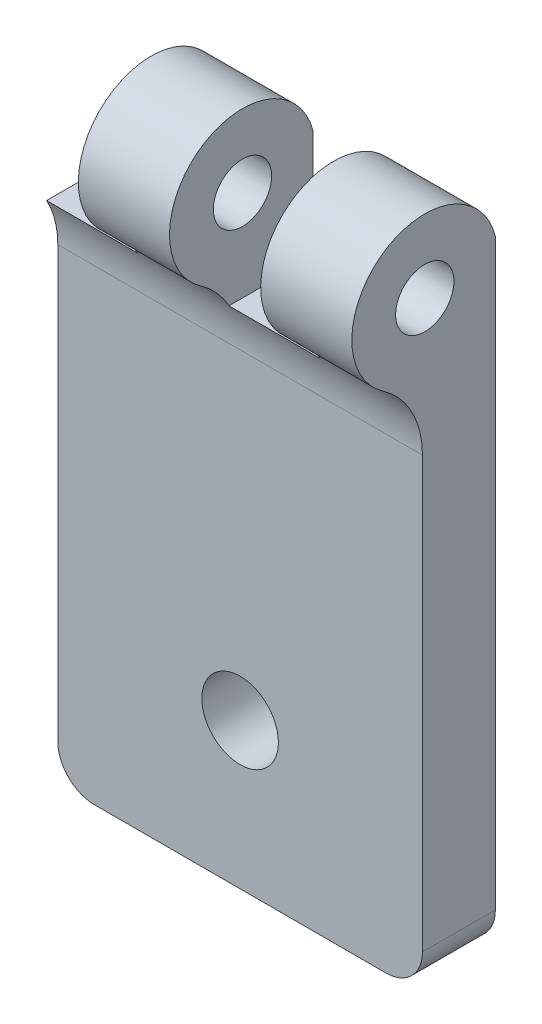
ISO-10303-21;
HEADER;
FILE_DESCRIPTION(('STEP AP214'),'2;1');
FILE_NAME('part.step','',(''),(''),'','','');
FILE_SCHEMA(('AUTOMOTIVE_DESIGN { 1 0 10303 214 1 1 1 1 }'));
ENDSEC;
DATA;
#1=APPLICATION_CONTEXT('core data for automotive mechanical design processes');
#2=APPLICATION_PROTOCOL_DEFINITION('international standard','automotive_design',2000,#1);
#3=PRODUCT_CONTEXT('',#1,'mechanical');
#4=PRODUCT('Part','Part','',(#3));
#5=PRODUCT_RELATED_PRODUCT_CATEGORY('part','',(#4));
#6=PRODUCT_DEFINITION_FORMATION('','',#4);
#7=PRODUCT_DEFINITION_CONTEXT('part definition',#1,'design');
#8=PRODUCT_DEFINITION('design','',#6,#7);
#9=PRODUCT_DEFINITION_SHAPE('','',#8);
#10=(LENGTH_UNIT() NAMED_UNIT(*) SI_UNIT(.MILLI.,.METRE.));
#11=(NAMED_UNIT(*) PLANE_ANGLE_UNIT() SI_UNIT($,.RADIAN.));
#12=(NAMED_UNIT(*) SI_UNIT($,.STERADIAN.) SOLID_ANGLE_UNIT());
#13=UNCERTAINTY_MEASURE_WITH_UNIT(LENGTH_MEASURE(1.E-05),#10,'distance_accuracy_value','');
#14=(GEOMETRIC_REPRESENTATION_CONTEXT(3) GLOBAL_UNCERTAINTY_ASSIGNED_CONTEXT((#13)) GLOBAL_UNIT_ASSIGNED_CONTEXT((#10,
#11,#12)) REPRESENTATION_CONTEXT('',''));
#15=CARTESIAN_POINT('',(0.,0.,0.));
#16=DIRECTION('',(0.,0.,1.));
#17=DIRECTION('',(1.,0.,0.));
#18=AXIS2_PLACEMENT_3D('',#15,#16,#17);
#19=CARTESIAN_POINT('',(-31.2224351555829,32.9979661007594,3.87245762594928));
#20=DIRECTION('',(1.,0.,0.));
#21=DIRECTION('',(0.,0.,-1.));
#22=AXIS2_PLACEMENT_3D('',#19,#20,#21);
#23=CYLINDRICAL_SURFACE('',#22,4.);
#24=CARTESIAN_POINT('',(-5.,32.9979661007594,3.87245762594928));
#25=DIRECTION('',(1.,0.,0.));
#26=DIRECTION('',(0.,0.,-1.));
#27=AXIS2_PLACEMENT_3D('',#24,#25,#26);
#28=CIRCLE('',#27,4.);
#29=CARTESIAN_POINT('',(-5.,29.7106298545688,6.1513653477496));
#30=VERTEX_POINT('',#29);
#31=CARTESIAN_POINT('',(-5.,34.,0.));
#32=VERTEX_POINT('',#31);
#33=EDGE_CURVE('E175',#30,#32,#28,.F.);
#34=ORIENTED_EDGE('',*,*,#33,.F.);
#35=DIRECTION('',(1.,0.,0.));
#36=VECTOR('',#35,1.);
#37=CARTESIAN_POINT('',(-31.2224351555829,29.7106298545688,6.1513653477496));
#38=LINE('',#37,#36);
#39=CARTESIAN_POINT('',(0.,29.7106298545688,6.1513653477496));
#40=VERTEX_POINT('',#39);
#41=EDGE_CURVE('E199',#30,#40,#38,.T.);
#42=ORIENTED_EDGE('',*,*,#41,.T.);
#43=CARTESIAN_POINT('',(0.,32.9979661007594,3.87245762594928));
#44=DIRECTION('',(1.,0.,0.));
#45=DIRECTION('',(0.,0.,-1.));
#46=AXIS2_PLACEMENT_3D('',#43,#44,#45);
#47=CIRCLE('',#46,4.);
#48=CARTESIAN_POINT('',(0.,34.,0.));
#49=VERTEX_POINT('',#48);
#50=EDGE_CURVE('E186',#49,#40,#47,.T.);
#51=ORIENTED_EDGE('',*,*,#50,.F.);
#52=DIRECTION('',(-1.,0.,0.));
#53=VECTOR('',#52,1.);
#54=CARTESIAN_POINT('',(0.,34.,0.));
#55=LINE('',#54,#53);
#56=EDGE_CURVE('E202',#49,#32,#55,.T.);
#57=ORIENTED_EDGE('',*,*,#56,.T.);
#58=EDGE_LOOP('',(#34,#42,#51,#57));
#59=FACE_BOUND('',#58,.T.);
#60=ADVANCED_FACE('F33',(#59),#23,.T.);
#61=CARTESIAN_POINT('',(-20.,32.9979661007594,3.87245762594928));
#62=DIRECTION('',(1.,0.,0.));
#63=DIRECTION('',(0.,0.,-1.));
#64=AXIS2_PLACEMENT_3D('',#61,#62,#63);
#65=CYLINDRICAL_SURFACE('',#64,1.6);
#66=CARTESIAN_POINT('',(-5.,32.9979661007594,3.87245762594928));
#67=DIRECTION('',(1.,0.,0.));
#68=DIRECTION('',(0.,0.,-1.));
#69=AXIS2_PLACEMENT_3D('',#66,#67,#68);
#70=CIRCLE('',#69,1.6);
#71=CARTESIAN_POINT('',(-5.,32.9979661007594,2.27245762594928));
#72=VERTEX_POINT('',#71);
#73=EDGE_CURVE('E171',#72,#72,#70,.F.);
#74=ORIENTED_EDGE('',*,*,#73,.T.);
#75=EDGE_LOOP('',(#74));
#76=FACE_BOUND('',#75,.T.);
#77=CARTESIAN_POINT('',(0.,32.9979661007594,3.87245762594928));
#78=DIRECTION('',(1.,0.,0.));
#79=DIRECTION('',(0.,0.,-1.));
#80=AXIS2_PLACEMENT_3D('',#77,#78,#79);
#81=CIRCLE('',#80,1.6);
#82=CARTESIAN_POINT('',(0.,32.9979661007594,2.27245762594928));
#83=VERTEX_POINT('',#82);
#84=EDGE_CURVE('E181',#83,#83,#81,.T.);
#85=ORIENTED_EDGE('',*,*,#84,.T.);
#86=EDGE_LOOP('',(#85));
#87=FACE_BOUND('',#86,.T.);
#88=ADVANCED_FACE('F255',(#76,#87),#65,.F.);
#89=CARTESIAN_POINT('',(0.,0.,4.));
#90=DIRECTION('',(-1.,0.,0.));
#91=DIRECTION('',(0.,0.,1.));
#92=AXIS2_PLACEMENT_3D('',#89,#90,#91);
#93=PLANE('',#92);
#94=ORIENTED_EDGE('',*,*,#84,.F.);
#95=EDGE_LOOP('',(#94));
#96=FACE_BOUND('',#95,.T.);
#97=DIRECTION('',(0.,1.,0.));
#98=VECTOR('',#97,1.);
#99=CARTESIAN_POINT('',(0.,0.,4.));
#100=LINE('',#99,#98);
#101=CARTESIAN_POINT('',(0.,2.,4.));
#102=VERTEX_POINT('',#101);
#103=CARTESIAN_POINT('',(0.,25.6014595468304,4.));
#104=VERTEX_POINT('',#103);
#105=EDGE_CURVE('E190',#102,#104,#100,.T.);
#106=ORIENTED_EDGE('',*,*,#105,.F.);
#107=DIRECTION('',(0.,0.,-1.));
#108=VECTOR('',#107,1.);
#109=CARTESIAN_POINT('',(0.,2.,4.));
#110=LINE('',#109,#108);
#111=CARTESIAN_POINT('',(0.,2.,0.));
#112=VERTEX_POINT('',#111);
#113=EDGE_CURVE('E218',#102,#112,#110,.T.);
#114=ORIENTED_EDGE('',*,*,#113,.T.);
#115=DIRECTION('',(0.,1.,0.));
#116=VECTOR('',#115,1.);
#117=CARTESIAN_POINT('',(0.,0.,0.));
#118=LINE('',#117,#116);
#119=EDGE_CURVE('E189',#112,#49,#118,.T.);
#120=ORIENTED_EDGE('',*,*,#119,.T.);
#121=ORIENTED_EDGE('',*,*,#50,.T.);
#122=CARTESIAN_POINT('',(0.,25.6014595468304,9.));
#123=DIRECTION('',(-1.,0.,0.));
#124=DIRECTION('',(0.,0.,1.));
#125=AXIS2_PLACEMENT_3D('',#122,#123,#124);
#126=CIRCLE('',#125,5.);
#127=EDGE_CURVE('E212',#40,#104,#126,.T.);
#128=ORIENTED_EDGE('',*,*,#127,.T.);
#129=EDGE_LOOP('',(#106,#114,#120,#121,#128));
#130=FACE_BOUND('',#129,.T.);
#131=ADVANCED_FACE('F262',(#96,#130),#93,.F.);
#132=CARTESIAN_POINT('',(-20.,0.,4.));
#133=DIRECTION('',(1.,0.,0.));
#134=DIRECTION('',(0.,0.,-1.));
#135=AXIS2_PLACEMENT_3D('',#132,#133,#134);
#136=PLANE('',#135);
#137=CARTESIAN_POINT('',(-20.,25.6014595468304,9.));
#138=DIRECTION('',(1.,0.,0.));
#139=DIRECTION('',(0.,0.,-1.));
#140=AXIS2_PLACEMENT_3D('',#137,#138,#139);
#141=CIRCLE('',#140,5.);
#142=CARTESIAN_POINT('',(-20.,25.6014595468304,4.));
#143=VERTEX_POINT('',#142);
#144=CARTESIAN_POINT('',(-20.,28.,4.61285928029323));
#145=VERTEX_POINT('',#144);
#146=EDGE_CURVE('E215',#143,#145,#141,.T.);
#147=ORIENTED_EDGE('',*,*,#146,.T.);
#148=DIRECTION('',(0.,0.,-1.));
#149=VECTOR('',#148,1.);
#150=CARTESIAN_POINT('',(-20.,28.,7.87245762594928));
#151=LINE('',#150,#149);
#152=CARTESIAN_POINT('',(-20.,28.,0.));
#153=VERTEX_POINT('',#152);
#154=EDGE_CURVE('E48',#145,#153,#151,.T.);
#155=ORIENTED_EDGE('',*,*,#154,.T.);
#156=DIRECTION('',(0.,-1.,0.));
#157=VECTOR('',#156,1.);
#158=CARTESIAN_POINT('',(-20.,0.,0.));
#159=LINE('',#158,#157);
#160=CARTESIAN_POINT('',(-20.,2.,0.));
#161=VERTEX_POINT('',#160);
#162=EDGE_CURVE('E146',#153,#161,#159,.T.);
#163=ORIENTED_EDGE('',*,*,#162,.T.);
#164=DIRECTION('',(0.,0.,-1.));
#165=VECTOR('',#164,1.);
#166=CARTESIAN_POINT('',(-20.,2.,4.));
#167=LINE('',#166,#165);
#168=CARTESIAN_POINT('',(-20.,2.,4.));
#169=VERTEX_POINT('',#168);
#170=EDGE_CURVE('E234',#161,#169,#167,.F.);
#171=ORIENTED_EDGE('',*,*,#170,.T.);
#172=DIRECTION('',(0.,-1.,0.));
#173=VECTOR('',#172,1.);
#174=CARTESIAN_POINT('',(-20.,0.,4.));
#175=LINE('',#174,#173);
#176=EDGE_CURVE('E192',#143,#169,#175,.T.);
#177=ORIENTED_EDGE('',*,*,#176,.F.);
#178=EDGE_LOOP('',(#147,#155,#163,#171,#177));
#179=FACE_BOUND('',#178,.T.);
#180=ADVANCED_FACE('F314',(#179),#136,.F.);
#181=CARTESIAN_POINT('',(0.,0.,4.));
#182=DIRECTION('',(0.,1.,0.));
#183=DIRECTION('',(-1.,0.,0.));
#184=AXIS2_PLACEMENT_3D('',#181,#182,#183);
#185=PLANE('',#184);
#186=DIRECTION('',(1.,0.,0.));
#187=VECTOR('',#186,1.);
#188=CARTESIAN_POINT('',(0.,0.,0.));
#189=LINE('',#188,#187);
#190=CARTESIAN_POINT('',(-18.,0.,0.));
#191=VERTEX_POINT('',#190);
#192=CARTESIAN_POINT('',(-2.,0.,0.));
#193=VERTEX_POINT('',#192);
#194=EDGE_CURVE('E193',#191,#193,#189,.T.);
#195=ORIENTED_EDGE('',*,*,#194,.T.);
#196=DIRECTION('',(0.,0.,-1.));
#197=VECTOR('',#196,1.);
#198=CARTESIAN_POINT('',(-2.,0.,4.));
#199=LINE('',#198,#197);
#200=CARTESIAN_POINT('',(-2.,0.,4.));
#201=VERTEX_POINT('',#200);
#202=EDGE_CURVE('E228',#193,#201,#199,.F.);
#203=ORIENTED_EDGE('',*,*,#202,.T.);
#204=DIRECTION('',(1.,0.,0.));
#205=VECTOR('',#204,1.);
#206=CARTESIAN_POINT('',(0.,0.,4.));
#207=LINE('',#206,#205);
#208=CARTESIAN_POINT('',(-18.,0.,4.));
#209=VERTEX_POINT('',#208);
#210=EDGE_CURVE('E196',#209,#201,#207,.T.);
#211=ORIENTED_EDGE('',*,*,#210,.F.);
#212=DIRECTION('',(0.,0.,-1.));
#213=VECTOR('',#212,1.);
#214=CARTESIAN_POINT('',(-18.,0.,4.));
#215=LINE('',#214,#213);
#216=EDGE_CURVE('E225',#209,#191,#215,.T.);
#217=ORIENTED_EDGE('',*,*,#216,.T.);
#218=EDGE_LOOP('',(#195,#203,#211,#217));
#219=FACE_BOUND('',#218,.T.);
#220=ADVANCED_FACE('F306',(#219),#185,.F.);
#221=CARTESIAN_POINT('',(0.,0.,4.));
#222=DIRECTION('',(0.,0.,1.));
#223=DIRECTION('',(1.,0.,0.));
#224=AXIS2_PLACEMENT_3D('',#221,#222,#223);
#225=PLANE('',#224);
#226=CARTESIAN_POINT('',(-10.,8.,4.));
#227=DIRECTION('',(0.,0.,1.));
#228=DIRECTION('',(1.,0.,0.));
#229=AXIS2_PLACEMENT_3D('',#226,#227,#228);
#230=CIRCLE('',#229,2.1);
#231=CARTESIAN_POINT('',(-7.9,8.,4.));
#232=VERTEX_POINT('',#231);
#233=EDGE_CURVE('E177',#232,#232,#230,.T.);
#234=ORIENTED_EDGE('',*,*,#233,.F.);
#235=EDGE_LOOP('',(#234));
#236=FACE_BOUND('',#235,.T.);
#237=ORIENTED_EDGE('',*,*,#210,.T.);
#238=CARTESIAN_POINT('',(-2.,2.,4.));
#239=DIRECTION('',(0.,0.,1.));
#240=DIRECTION('',(1.,0.,0.));
#241=AXIS2_PLACEMENT_3D('',#238,#239,#240);
#242=CIRCLE('',#241,2.);
#243=EDGE_CURVE('E232',#201,#102,#242,.T.);
#244=ORIENTED_EDGE('',*,*,#243,.T.);
#245=ORIENTED_EDGE('',*,*,#105,.T.);
#246=DIRECTION('',(-1.,0.,0.));
#247=VECTOR('',#246,1.);
#248=CARTESIAN_POINT('',(-20.,25.6014595468304,4.));
#249=LINE('',#248,#247);
#250=EDGE_CURVE('E210',#104,#143,#249,.T.);
#251=ORIENTED_EDGE('',*,*,#250,.T.);
#252=ORIENTED_EDGE('',*,*,#176,.T.);
#253=CARTESIAN_POINT('',(-18.,2.,4.));
#254=DIRECTION('',(0.,0.,1.));
#255=DIRECTION('',(1.,0.,0.));
#256=AXIS2_PLACEMENT_3D('',#253,#254,#255);
#257=CIRCLE('',#256,2.);
#258=EDGE_CURVE('E230',#169,#209,#257,.T.);
#259=ORIENTED_EDGE('',*,*,#258,.T.);
#260=EDGE_LOOP('',(#237,#244,#245,#251,#252,#259));
#261=FACE_BOUND('',#260,.T.);
#262=ADVANCED_FACE('F275',(#236,#261),#225,.T.);
#263=CARTESIAN_POINT('',(0.,0.,0.));
#264=DIRECTION('',(0.,0.,1.));
#265=DIRECTION('',(1.,0.,0.));
#266=AXIS2_PLACEMENT_3D('',#263,#264,#265);
#267=PLANE('',#266);
#268=CARTESIAN_POINT('',(-10.,8.,0.));
#269=DIRECTION('',(0.,0.,1.));
#270=DIRECTION('',(1.,0.,0.));
#271=AXIS2_PLACEMENT_3D('',#268,#269,#270);
#272=CIRCLE('',#271,2.1);
#273=CARTESIAN_POINT('',(-7.9,8.,0.));
#274=VERTEX_POINT('',#273);
#275=EDGE_CURVE('E178',#274,#274,#272,.T.);
#276=ORIENTED_EDGE('',*,*,#275,.T.);
#277=EDGE_LOOP('',(#276));
#278=FACE_BOUND('',#277,.T.);
#279=DIRECTION('',(-1.,0.,0.));
#280=VECTOR('',#279,1.);
#281=CARTESIAN_POINT('',(-15.,28.,0.));
#282=LINE('',#281,#280);
#283=CARTESIAN_POINT('',(-15.,28.,0.));
#284=VERTEX_POINT('',#283);
#285=EDGE_CURVE('E129',#284,#153,#282,.T.);
#286=ORIENTED_EDGE('',*,*,#285,.F.);
#287=DIRECTION('',(0.,-1.,0.));
#288=VECTOR('',#287,1.);
#289=CARTESIAN_POINT('',(-15.,28.,0.));
#290=LINE('',#289,#288);
#291=CARTESIAN_POINT('',(-15.,34.,0.));
#292=VERTEX_POINT('',#291);
#293=EDGE_CURVE('E135',#292,#284,#290,.T.);
#294=ORIENTED_EDGE('',*,*,#293,.F.);
#295=CARTESIAN_POINT('',(-10.,34.,0.));
#296=VERTEX_POINT('',#295);
#297=EDGE_CURVE('E201',#296,#292,#55,.T.);
#298=ORIENTED_EDGE('',*,*,#297,.F.);
#299=DIRECTION('',(0.,1.,0.));
#300=VECTOR('',#299,1.);
#301=CARTESIAN_POINT('',(-10.,28.,0.));
#302=LINE('',#301,#300);
#303=CARTESIAN_POINT('',(-10.,28.,0.));
#304=VERTEX_POINT('',#303);
#305=EDGE_CURVE('E159',#304,#296,#302,.T.);
#306=ORIENTED_EDGE('',*,*,#305,.F.);
#307=DIRECTION('',(-1.,0.,0.));
#308=VECTOR('',#307,1.);
#309=CARTESIAN_POINT('',(-5.,28.,0.));
#310=LINE('',#309,#308);
#311=CARTESIAN_POINT('',(-5.,28.,0.));
#312=VERTEX_POINT('',#311);
#313=EDGE_CURVE('E157',#312,#304,#310,.T.);
#314=ORIENTED_EDGE('',*,*,#313,.F.);
#315=DIRECTION('',(0.,-1.,0.));
#316=VECTOR('',#315,1.);
#317=CARTESIAN_POINT('',(-5.,28.,0.));
#318=LINE('',#317,#316);
#319=EDGE_CURVE('E154',#32,#312,#318,.T.);
#320=ORIENTED_EDGE('',*,*,#319,.F.);
#321=ORIENTED_EDGE('',*,*,#56,.F.);
#322=ORIENTED_EDGE('',*,*,#119,.F.);
#323=CARTESIAN_POINT('',(-2.,2.,0.));
#324=DIRECTION('',(0.,0.,1.));
#325=DIRECTION('',(1.,0.,0.));
#326=AXIS2_PLACEMENT_3D('',#323,#324,#325);
#327=CIRCLE('',#326,2.);
#328=EDGE_CURVE('E223',#112,#193,#327,.F.);
#329=ORIENTED_EDGE('',*,*,#328,.T.);
#330=ORIENTED_EDGE('',*,*,#194,.F.);
#331=CARTESIAN_POINT('',(-18.,2.,0.));
#332=DIRECTION('',(0.,0.,1.));
#333=DIRECTION('',(1.,0.,0.));
#334=AXIS2_PLACEMENT_3D('',#331,#332,#333);
#335=CIRCLE('',#334,2.);
#336=EDGE_CURVE('E221',#191,#161,#335,.F.);
#337=ORIENTED_EDGE('',*,*,#336,.T.);
#338=ORIENTED_EDGE('',*,*,#162,.F.);
#339=EDGE_LOOP('',(#286,#294,#298,#306,#314,#320,#321,#322,#329,#330,#337,#338));
#340=FACE_BOUND('',#339,.T.);
#341=ADVANCED_FACE('F144',(#278,#340),#267,.F.);
#342=CARTESIAN_POINT('',(-15.,32.9979661007594,3.87245762594928));
#343=DIRECTION('',(1.,0.,0.));
#344=DIRECTION('',(0.,0.,-1.));
#345=AXIS2_PLACEMENT_3D('',#342,#343,#344);
#346=CIRCLE('',#345,4.);
#347=CARTESIAN_POINT('',(-15.,29.7106298545688,6.1513653477496));
#348=VERTEX_POINT('',#347);
#349=EDGE_CURVE('E138',#348,#292,#346,.F.);
#350=ORIENTED_EDGE('',*,*,#349,.F.);
#351=CARTESIAN_POINT('',(-10.,29.7106298545688,6.1513653477496));
#352=VERTEX_POINT('',#351);
#353=EDGE_CURVE('E208',#348,#352,#38,.T.);
#354=ORIENTED_EDGE('',*,*,#353,.T.);
#355=CARTESIAN_POINT('',(-10.,32.9979661007594,3.87245762594928));
#356=DIRECTION('',(-1.,0.,0.));
#357=DIRECTION('',(0.,0.,1.));
#358=AXIS2_PLACEMENT_3D('',#355,#356,#357);
#359=CIRCLE('',#358,4.);
#360=EDGE_CURVE('E168',#296,#352,#359,.F.);
#361=ORIENTED_EDGE('',*,*,#360,.F.);
#362=ORIENTED_EDGE('',*,*,#297,.T.);
#363=EDGE_LOOP('',(#350,#354,#361,#362));
#364=FACE_BOUND('',#363,.T.);
#365=ADVANCED_FACE('F258',(#364),#23,.T.);
#366=CARTESIAN_POINT('',(-31.2224351555829,25.6014595468304,9.));
#367=DIRECTION('',(1.,0.,0.));
#368=DIRECTION('',(0.,0.,-1.));
#369=AXIS2_PLACEMENT_3D('',#366,#367,#368);
#370=CYLINDRICAL_SURFACE('',#369,5.);
#371=ORIENTED_EDGE('',*,*,#353,.F.);
#372=CARTESIAN_POINT('',(-15.,25.6014595468304,9.));
#373=DIRECTION('',(1.,0.,0.));
#374=DIRECTION('',(0.,0.,-1.));
#375=AXIS2_PLACEMENT_3D('',#372,#373,#374);
#376=CIRCLE('',#375,5.);
#377=CARTESIAN_POINT('',(-15.,28.,4.61285928029323));
#378=VERTEX_POINT('',#377);
#379=EDGE_CURVE('E151',#348,#378,#376,.F.);
#380=ORIENTED_EDGE('',*,*,#379,.T.);
#381=DIRECTION('',(1.,0.,0.));
#382=VECTOR('',#381,1.);
#383=CARTESIAN_POINT('',(-31.2224351555829,28.,4.61285928029323));
#384=LINE('',#383,#382);
#385=EDGE_CURVE('E11',#378,#145,#384,.F.);
#386=ORIENTED_EDGE('',*,*,#385,.T.);
#387=ORIENTED_EDGE('',*,*,#146,.F.);
#388=ORIENTED_EDGE('',*,*,#250,.F.);
#389=ORIENTED_EDGE('',*,*,#127,.F.);
#390=ORIENTED_EDGE('',*,*,#41,.F.);
#391=CARTESIAN_POINT('',(-5.,25.6014595468304,9.));
#392=DIRECTION('',(1.,0.,0.));
#393=DIRECTION('',(0.,0.,-1.));
#394=AXIS2_PLACEMENT_3D('',#391,#392,#393);
#395=CIRCLE('',#394,5.);
#396=CARTESIAN_POINT('',(-5.,28.,4.61285928029323));
#397=VERTEX_POINT('',#396);
#398=EDGE_CURVE('E172',#30,#397,#395,.F.);
#399=ORIENTED_EDGE('',*,*,#398,.T.);
#400=DIRECTION('',(1.,0.,0.));
#401=VECTOR('',#400,1.);
#402=CARTESIAN_POINT('',(-31.2224351555829,28.,4.61285928029323));
#403=LINE('',#402,#401);
#404=CARTESIAN_POINT('',(-10.,28.,4.61285928029323));
#405=VERTEX_POINT('',#404);
#406=EDGE_CURVE('E41',#397,#405,#403,.F.);
#407=ORIENTED_EDGE('',*,*,#406,.T.);
#408=CARTESIAN_POINT('',(-10.,25.6014595468304,9.));
#409=DIRECTION('',(-1.,0.,0.));
#410=DIRECTION('',(0.,0.,1.));
#411=AXIS2_PLACEMENT_3D('',#408,#409,#410);
#412=CIRCLE('',#411,5.);
#413=EDGE_CURVE('E165',#405,#352,#412,.F.);
#414=ORIENTED_EDGE('',*,*,#413,.T.);
#415=EDGE_LOOP('',(#371,#380,#386,#387,#388,#389,#390,#399,#407,#414));
#416=FACE_BOUND('',#415,.T.);
#417=ADVANCED_FACE('F267',(#416),#370,.F.);
#418=CARTESIAN_POINT('',(-15.,32.9979661007594,3.87245762594928));
#419=DIRECTION('',(1.,0.,0.));
#420=DIRECTION('',(0.,0.,-1.));
#421=AXIS2_PLACEMENT_3D('',#418,#419,#420);
#422=CIRCLE('',#421,1.6);
#423=CARTESIAN_POINT('',(-15.,32.9979661007594,2.27245762594928));
#424=VERTEX_POINT('',#423);
#425=EDGE_CURVE('E149',#424,#424,#422,.F.);
#426=ORIENTED_EDGE('',*,*,#425,.T.);
#427=EDGE_LOOP('',(#426));
#428=FACE_BOUND('',#427,.T.);
#429=CARTESIAN_POINT('',(-10.,32.9979661007594,3.87245762594928));
#430=DIRECTION('',(-1.,0.,0.));
#431=DIRECTION('',(0.,0.,1.));
#432=AXIS2_PLACEMENT_3D('',#429,#430,#431);
#433=CIRCLE('',#432,1.6);
#434=CARTESIAN_POINT('',(-10.,32.9979661007594,5.47245762594928));
#435=VERTEX_POINT('',#434);
#436=EDGE_CURVE('E163',#435,#435,#433,.F.);
#437=ORIENTED_EDGE('',*,*,#436,.T.);
#438=EDGE_LOOP('',(#437));
#439=FACE_BOUND('',#438,.T.);
#440=ADVANCED_FACE('F244',(#428,#439),#65,.F.);
#441=CARTESIAN_POINT('',(-10.,8.,0.));
#442=DIRECTION('',(0.,0.,1.));
#443=DIRECTION('',(1.,0.,0.));
#444=AXIS2_PLACEMENT_3D('',#441,#442,#443);
#445=CYLINDRICAL_SURFACE('',#444,2.1);
#446=ORIENTED_EDGE('',*,*,#275,.F.);
#447=EDGE_LOOP('',(#446));
#448=FACE_BOUND('',#447,.T.);
#449=ORIENTED_EDGE('',*,*,#233,.T.);
#450=EDGE_LOOP('',(#449));
#451=FACE_BOUND('',#450,.T.);
#452=ADVANCED_FACE('F327',(#448,#451),#445,.F.);
#453=CARTESIAN_POINT('',(-2.,2.,4.));
#454=DIRECTION('',(0.,0.,-1.));
#455=DIRECTION('',(-1.,0.,0.));
#456=AXIS2_PLACEMENT_3D('',#453,#454,#455);
#457=CYLINDRICAL_SURFACE('',#456,2.);
#458=ORIENTED_EDGE('',*,*,#243,.F.);
#459=ORIENTED_EDGE('',*,*,#202,.F.);
#460=ORIENTED_EDGE('',*,*,#328,.F.);
#461=ORIENTED_EDGE('',*,*,#113,.F.);
#462=EDGE_LOOP('',(#458,#459,#460,#461));
#463=FACE_BOUND('',#462,.T.);
#464=ADVANCED_FACE('F302',(#463),#457,.T.);
#465=CARTESIAN_POINT('',(-18.,2.,4.));
#466=DIRECTION('',(0.,0.,-1.));
#467=DIRECTION('',(-1.,0.,0.));
#468=AXIS2_PLACEMENT_3D('',#465,#466,#467);
#469=CYLINDRICAL_SURFACE('',#468,2.);
#470=ORIENTED_EDGE('',*,*,#258,.F.);
#471=ORIENTED_EDGE('',*,*,#170,.F.);
#472=ORIENTED_EDGE('',*,*,#336,.F.);
#473=ORIENTED_EDGE('',*,*,#216,.F.);
#474=EDGE_LOOP('',(#470,#471,#472,#473));
#475=FACE_BOUND('',#474,.T.);
#476=ADVANCED_FACE('F35',(#475),#469,.T.);
#477=CARTESIAN_POINT('',(-5.,28.,7.87245762594928));
#478=DIRECTION('',(0.,-1.,0.));
#479=DIRECTION('',(1.,0.,0.));
#480=AXIS2_PLACEMENT_3D('',#477,#478,#479);
#481=PLANE('',#480);
#482=DIRECTION('',(0.,0.,-1.));
#483=VECTOR('',#482,1.);
#484=CARTESIAN_POINT('',(-5.,28.,7.87245762594928));
#485=LINE('',#484,#483);
#486=EDGE_CURVE('E161',#397,#312,#485,.T.);
#487=ORIENTED_EDGE('',*,*,#486,.T.);
#488=ORIENTED_EDGE('',*,*,#313,.T.);
#489=DIRECTION('',(0.,0.,-1.));
#490=VECTOR('',#489,1.);
#491=CARTESIAN_POINT('',(-10.,28.,7.87245762594928));
#492=LINE('',#491,#490);
#493=EDGE_CURVE('E55',#405,#304,#492,.T.);
#494=ORIENTED_EDGE('',*,*,#493,.F.);
#495=ORIENTED_EDGE('',*,*,#406,.F.);
#496=EDGE_LOOP('',(#487,#488,#494,#495));
#497=FACE_BOUND('',#496,.T.);
#498=ADVANCED_FACE('F286',(#497),#481,.F.);
#499=CARTESIAN_POINT('',(-5.,28.,7.87245762594928));
#500=DIRECTION('',(1.,0.,0.));
#501=DIRECTION('',(0.,0.,-1.));
#502=AXIS2_PLACEMENT_3D('',#499,#500,#501);
#503=PLANE('',#502);
#504=ORIENTED_EDGE('',*,*,#33,.T.);
#505=ORIENTED_EDGE('',*,*,#319,.T.);
#506=ORIENTED_EDGE('',*,*,#486,.F.);
#507=ORIENTED_EDGE('',*,*,#398,.F.);
#508=EDGE_LOOP('',(#504,#505,#506,#507));
#509=FACE_BOUND('',#508,.T.);
#510=ORIENTED_EDGE('',*,*,#73,.F.);
#511=EDGE_LOOP('',(#510));
#512=FACE_BOUND('',#511,.T.);
#513=ADVANCED_FACE('F290',(#509,#512),#503,.F.);
#514=CARTESIAN_POINT('',(-10.,28.,7.87245762594928));
#515=DIRECTION('',(-1.,0.,0.));
#516=DIRECTION('',(0.,0.,1.));
#517=AXIS2_PLACEMENT_3D('',#514,#515,#516);
#518=PLANE('',#517);
#519=ORIENTED_EDGE('',*,*,#360,.T.);
#520=ORIENTED_EDGE('',*,*,#413,.F.);
#521=ORIENTED_EDGE('',*,*,#493,.T.);
#522=ORIENTED_EDGE('',*,*,#305,.T.);
#523=EDGE_LOOP('',(#519,#520,#521,#522));
#524=FACE_BOUND('',#523,.T.);
#525=ORIENTED_EDGE('',*,*,#436,.F.);
#526=EDGE_LOOP('',(#525));
#527=FACE_BOUND('',#526,.T.);
#528=ADVANCED_FACE('F251',(#524,#527),#518,.F.);
#529=CARTESIAN_POINT('',(-15.,28.,7.87245762594928));
#530=DIRECTION('',(0.,-1.,0.));
#531=DIRECTION('',(0.,0.,-1.));
#532=AXIS2_PLACEMENT_3D('',#529,#530,#531);
#533=PLANE('',#532);
#534=DIRECTION('',(0.,0.,-1.));
#535=VECTOR('',#534,1.);
#536=CARTESIAN_POINT('',(-15.,28.,7.87245762594928));
#537=LINE('',#536,#535);
#538=EDGE_CURVE('E125',#378,#284,#537,.T.);
#539=ORIENTED_EDGE('',*,*,#538,.T.);
#540=ORIENTED_EDGE('',*,*,#285,.T.);
#541=ORIENTED_EDGE('',*,*,#154,.F.);
#542=ORIENTED_EDGE('',*,*,#385,.F.);
#543=EDGE_LOOP('',(#539,#540,#541,#542));
#544=FACE_BOUND('',#543,.T.);
#545=ADVANCED_FACE('F127',(#544),#533,.F.);
#546=CARTESIAN_POINT('',(-15.,28.,7.87245762594928));
#547=DIRECTION('',(1.,0.,0.));
#548=DIRECTION('',(0.,0.,-1.));
#549=AXIS2_PLACEMENT_3D('',#546,#547,#548);
#550=PLANE('',#549);
#551=ORIENTED_EDGE('',*,*,#349,.T.);
#552=ORIENTED_EDGE('',*,*,#293,.T.);
#553=ORIENTED_EDGE('',*,*,#538,.F.);
#554=ORIENTED_EDGE('',*,*,#379,.F.);
#555=EDGE_LOOP('',(#551,#552,#553,#554));
#556=FACE_BOUND('',#555,.T.);
#557=ORIENTED_EDGE('',*,*,#425,.F.);
#558=EDGE_LOOP('',(#557));
#559=FACE_BOUND('',#558,.T.);
#560=ADVANCED_FACE('F136',(#556,#559),#550,.F.);
#561=CLOSED_SHELL('',(#60,#88,#131,#180,#220,#262,#341,#365,#417,#440,#452,#464,#476,#498,#513,
#528,#545,#560));
#562=MANIFOLD_SOLID_BREP('B2',#561);
#563=ADVANCED_BREP_SHAPE_REPRESENTATION('',(#18,#562),#14);
#564=SHAPE_DEFINITION_REPRESENTATION(#9,#563);
ENDSEC;
END-ISO-10303-21;
